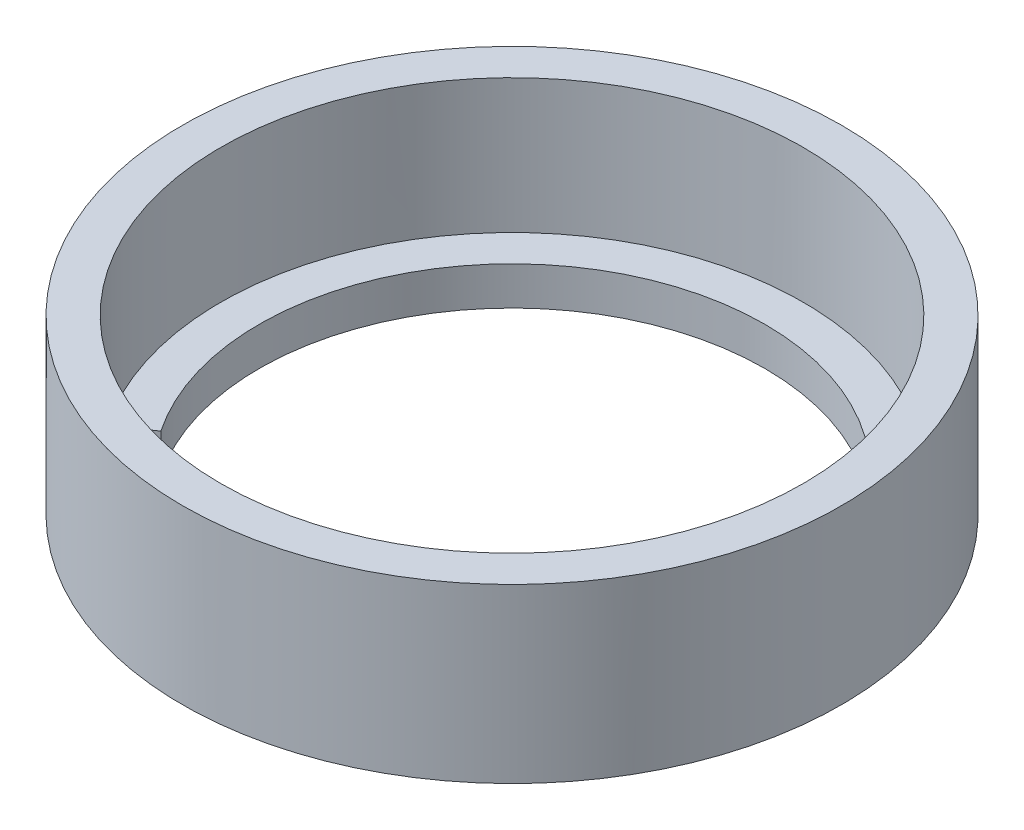
ISO-10303-21;
HEADER;
FILE_DESCRIPTION(('STEP AP214'),'2;1');
FILE_NAME('part.step','',(''),(''),'','','');
FILE_SCHEMA(('AUTOMOTIVE_DESIGN { 1 0 10303 214 1 1 1 1 }'));
ENDSEC;
DATA;
#1=APPLICATION_CONTEXT('core data for automotive mechanical design processes');
#2=APPLICATION_PROTOCOL_DEFINITION('international standard','automotive_design',2000,#1);
#3=PRODUCT_CONTEXT('',#1,'mechanical');
#4=PRODUCT('Part','Part','',(#3));
#5=PRODUCT_RELATED_PRODUCT_CATEGORY('part','',(#4));
#6=PRODUCT_DEFINITION_FORMATION('','',#4);
#7=PRODUCT_DEFINITION_CONTEXT('part definition',#1,'design');
#8=PRODUCT_DEFINITION('design','',#6,#7);
#9=PRODUCT_DEFINITION_SHAPE('','',#8);
#10=(LENGTH_UNIT() NAMED_UNIT(*) SI_UNIT(.MILLI.,.METRE.));
#11=(NAMED_UNIT(*) PLANE_ANGLE_UNIT() SI_UNIT($,.RADIAN.));
#12=(NAMED_UNIT(*) SI_UNIT($,.STERADIAN.) SOLID_ANGLE_UNIT());
#13=UNCERTAINTY_MEASURE_WITH_UNIT(LENGTH_MEASURE(1.E-05),#10,'distance_accuracy_value','');
#14=(GEOMETRIC_REPRESENTATION_CONTEXT(3) GLOBAL_UNCERTAINTY_ASSIGNED_CONTEXT((#13)) GLOBAL_UNIT_ASSIGNED_CONTEXT((#10,
#11,#12)) REPRESENTATION_CONTEXT('',''));
#15=CARTESIAN_POINT('',(0.,0.,0.));
#16=DIRECTION('',(0.,0.,1.));
#17=DIRECTION('',(1.,0.,0.));
#18=AXIS2_PLACEMENT_3D('',#15,#16,#17);
#19=CARTESIAN_POINT('',(0.,7.,0.));
#20=DIRECTION('',(0.,1.,0.));
#21=DIRECTION('',(0.,0.,1.));
#22=AXIS2_PLACEMENT_3D('',#19,#20,#21);
#23=PLANE('',#22);
#24=CARTESIAN_POINT('',(0.,7.,0.));
#25=DIRECTION('',(0.,1.,0.));
#26=DIRECTION('',(0.,0.,1.));
#27=AXIS2_PLACEMENT_3D('',#24,#25,#26);
#28=CIRCLE('',#27,17.2);
#29=CARTESIAN_POINT('',(0.,7.,17.2));
#30=VERTEX_POINT('',#29);
#31=EDGE_CURVE('E11',#30,#30,#28,.T.);
#32=ORIENTED_EDGE('',*,*,#31,.T.);
#33=EDGE_LOOP('',(#32));
#34=FACE_BOUND('',#33,.T.);
#35=CARTESIAN_POINT('',(0.,7.,0.));
#36=DIRECTION('',(0.,1.,0.));
#37=DIRECTION('',(0.,0.,1.));
#38=AXIS2_PLACEMENT_3D('',#35,#36,#37);
#39=CIRCLE('',#38,15.2);
#40=CARTESIAN_POINT('',(0.,7.,15.2));
#41=VERTEX_POINT('',#40);
#42=EDGE_CURVE('E46',#41,#41,#39,.T.);
#43=ORIENTED_EDGE('',*,*,#42,.F.);
#44=EDGE_LOOP('',(#43));
#45=FACE_BOUND('',#44,.T.);
#46=ADVANCED_FACE('F37',(#34,#45),#23,.T.);
#47=CARTESIAN_POINT('',(0.,7.,0.));
#48=DIRECTION('',(0.,-1.,0.));
#49=DIRECTION('',(0.,0.,-1.));
#50=AXIS2_PLACEMENT_3D('',#47,#48,#49);
#51=CYLINDRICAL_SURFACE('',#50,17.2);
#52=ORIENTED_EDGE('',*,*,#31,.F.);
#53=EDGE_LOOP('',(#52));
#54=FACE_BOUND('',#53,.T.);
#55=CARTESIAN_POINT('',(0.,-2.,0.));
#56=DIRECTION('',(0.,-1.,0.));
#57=DIRECTION('',(0.,0.,-1.));
#58=AXIS2_PLACEMENT_3D('',#55,#56,#57);
#59=CIRCLE('',#58,17.2);
#60=CARTESIAN_POINT('',(0.,-2.,-17.2));
#61=VERTEX_POINT('',#60);
#62=EDGE_CURVE('E124',#61,#61,#59,.T.);
#63=ORIENTED_EDGE('',*,*,#62,.F.);
#64=EDGE_LOOP('',(#63));
#65=FACE_BOUND('',#64,.T.);
#66=ADVANCED_FACE('F39',(#54,#65),#51,.T.);
#67=CARTESIAN_POINT('',(0.,7.,0.));
#68=DIRECTION('',(0.,-1.,0.));
#69=DIRECTION('',(0.,0.,-1.));
#70=AXIS2_PLACEMENT_3D('',#67,#68,#69);
#71=CYLINDRICAL_SURFACE('',#70,15.2);
#72=ORIENTED_EDGE('',*,*,#42,.T.);
#73=EDGE_LOOP('',(#72));
#74=FACE_BOUND('',#73,.T.);
#75=CARTESIAN_POINT('',(0.,0.,0.));
#76=DIRECTION('',(0.,1.,0.));
#77=DIRECTION('',(0.,0.,1.));
#78=AXIS2_PLACEMENT_3D('',#75,#76,#77);
#79=CIRCLE('',#78,15.2);
#80=CARTESIAN_POINT('',(12.5913147397296,0.,8.51462231253208));
#81=VERTEX_POINT('',#80);
#82=CARTESIAN_POINT('',(-12.5913147397296,0.,8.51462231253206));
#83=VERTEX_POINT('',#82);
#84=EDGE_CURVE('E61',#81,#83,#79,.T.);
#85=ORIENTED_EDGE('',*,*,#84,.F.);
#86=DIRECTION('',(0.,1.,0.));
#87=VECTOR('',#86,1.);
#88=CARTESIAN_POINT('',(12.5913147397296,-2.,8.51462231253208));
#89=LINE('',#88,#87);
#90=CARTESIAN_POINT('',(12.5913147397296,-2.,8.51462231253208));
#91=VERTEX_POINT('',#90);
#92=EDGE_CURVE('E125',#91,#81,#89,.T.);
#93=ORIENTED_EDGE('',*,*,#92,.F.);
#94=CARTESIAN_POINT('',(0.,-2.,0.));
#95=DIRECTION('',(0.,-1.,0.));
#96=DIRECTION('',(0.,0.,1.));
#97=AXIS2_PLACEMENT_3D('',#94,#95,#96);
#98=CIRCLE('',#97,15.2);
#99=CARTESIAN_POINT('',(4.20695679802556,-2.,14.6062149271995));
#100=VERTEX_POINT('',#99);
#101=EDGE_CURVE('E130',#91,#100,#98,.T.);
#102=ORIENTED_EDGE('',*,*,#101,.T.);
#103=DIRECTION('',(0.,1.,0.));
#104=VECTOR('',#103,1.);
#105=CARTESIAN_POINT('',(4.20695679802556,-2.,14.6062149271995));
#106=LINE('',#105,#104);
#107=CARTESIAN_POINT('',(4.20695679802556,0.,14.6062149271995));
#108=VERTEX_POINT('',#107);
#109=EDGE_CURVE('E167',#100,#108,#106,.T.);
#110=ORIENTED_EDGE('',*,*,#109,.T.);
#111=CARTESIAN_POINT('',(-4.20695679802558,0.,14.6062149271995));
#112=VERTEX_POINT('',#111);
#113=EDGE_CURVE('E53',#112,#108,#79,.T.);
#114=ORIENTED_EDGE('',*,*,#113,.F.);
#115=DIRECTION('',(0.,1.,0.));
#116=VECTOR('',#115,1.);
#117=CARTESIAN_POINT('',(-4.20695679802559,-2.,14.6062149271995));
#118=LINE('',#117,#116);
#119=CARTESIAN_POINT('',(-4.20695679802559,-2.,14.6062149271995));
#120=VERTEX_POINT('',#119);
#121=EDGE_CURVE('E161',#120,#112,#118,.T.);
#122=ORIENTED_EDGE('',*,*,#121,.F.);
#123=CARTESIAN_POINT('',(0.,-2.,0.));
#124=DIRECTION('',(0.,-1.,0.));
#125=DIRECTION('',(0.,0.,1.));
#126=AXIS2_PLACEMENT_3D('',#123,#124,#125);
#127=CIRCLE('',#126,15.2);
#128=CARTESIAN_POINT('',(-12.5913147397296,-2.,8.51462231253206));
#129=VERTEX_POINT('',#128);
#130=EDGE_CURVE('E140',#120,#129,#127,.T.);
#131=ORIENTED_EDGE('',*,*,#130,.T.);
#132=DIRECTION('',(0.,1.,0.));
#133=VECTOR('',#132,1.);
#134=CARTESIAN_POINT('',(-12.5913147397296,-2.,8.51462231253206));
#135=LINE('',#134,#133);
#136=EDGE_CURVE('E159',#129,#83,#135,.T.);
#137=ORIENTED_EDGE('',*,*,#136,.T.);
#138=EDGE_LOOP('',(#85,#93,#102,#110,#114,#122,#131,#137));
#139=FACE_BOUND('',#138,.T.);
#140=ADVANCED_FACE('F179',(#74,#139),#71,.F.);
#141=CARTESIAN_POINT('',(0.,0.,0.));
#142=DIRECTION('',(0.,-1.,0.));
#143=DIRECTION('',(0.,0.,-1.));
#144=AXIS2_PLACEMENT_3D('',#141,#142,#143);
#145=PLANE('',#144);
#146=DIRECTION('',(0.82837596971905,0.,0.560172520561321));
#147=VECTOR('',#146,1.);
#148=CARTESIAN_POINT('',(10.9345628002915,0.,7.39427727140944));
#149=LINE('',#148,#147);
#150=CARTESIAN_POINT('',(10.9345628002915,0.,7.39427727140944));
#151=VERTEX_POINT('',#150);
#152=EDGE_CURVE('E123',#151,#81,#149,.T.);
#153=ORIENTED_EDGE('',*,*,#152,.T.);
#154=ORIENTED_EDGE('',*,*,#84,.T.);
#155=DIRECTION('',(0.828375969719051,0.,-0.56017252056132));
#156=VECTOR('',#155,1.);
#157=CARTESIAN_POINT('',(-10.9345628002915,0.,7.39427727140942));
#158=LINE('',#157,#156);
#159=CARTESIAN_POINT('',(-10.9345628002915,0.,7.39427727140942));
#160=VERTEX_POINT('',#159);
#161=EDGE_CURVE('E117',#83,#160,#158,.T.);
#162=ORIENTED_EDGE('',*,*,#161,.T.);
#163=CARTESIAN_POINT('',(0.,0.,0.));
#164=DIRECTION('',(0.,-1.,0.));
#165=DIRECTION('',(0.,0.,-1.));
#166=AXIS2_PLACEMENT_3D('',#163,#164,#165);
#167=CIRCLE('',#166,13.2);
#168=EDGE_CURVE('E145',#160,#151,#167,.T.);
#169=ORIENTED_EDGE('',*,*,#168,.T.);
#170=EDGE_LOOP('',(#153,#154,#162,#169));
#171=FACE_BOUND('',#170,.T.);
#172=ADVANCED_FACE('F195',(#171),#145,.F.);
#173=DIRECTION('',(-0.276773473554315,0.,0.960935192578916));
#174=VECTOR('',#173,1.);
#175=CARTESIAN_POINT('',(-3.65340985091695,0.,12.6843445420417));
#176=LINE('',#175,#174);
#177=CARTESIAN_POINT('',(-3.65340985091695,0.,12.6843445420417));
#178=VERTEX_POINT('',#177);
#179=EDGE_CURVE('E154',#178,#112,#176,.T.);
#180=ORIENTED_EDGE('',*,*,#179,.T.);
#181=ORIENTED_EDGE('',*,*,#113,.T.);
#182=DIRECTION('',(-0.276773473554313,0.,-0.960935192578917));
#183=VECTOR('',#182,1.);
#184=CARTESIAN_POINT('',(3.65340985091694,0.,12.6843445420417));
#185=LINE('',#184,#183);
#186=CARTESIAN_POINT('',(3.65340985091694,0.,12.6843445420417));
#187=VERTEX_POINT('',#186);
#188=EDGE_CURVE('E148',#108,#187,#185,.T.);
#189=ORIENTED_EDGE('',*,*,#188,.T.);
#190=CARTESIAN_POINT('',(0.,0.,0.));
#191=DIRECTION('',(0.,-1.,0.));
#192=DIRECTION('',(0.,0.,-1.));
#193=AXIS2_PLACEMENT_3D('',#190,#191,#192);
#194=CIRCLE('',#193,13.2);
#195=EDGE_CURVE('E151',#187,#178,#194,.T.);
#196=ORIENTED_EDGE('',*,*,#195,.T.);
#197=EDGE_LOOP('',(#180,#181,#189,#196));
#198=FACE_BOUND('',#197,.T.);
#199=ADVANCED_FACE('F175',(#198),#145,.F.);
#200=CARTESIAN_POINT('',(0.,-2.,0.));
#201=DIRECTION('',(0.,-1.,0.));
#202=DIRECTION('',(0.,0.,-1.));
#203=AXIS2_PLACEMENT_3D('',#200,#201,#202);
#204=PLANE('',#203);
#205=ORIENTED_EDGE('',*,*,#62,.T.);
#206=EDGE_LOOP('',(#205));
#207=FACE_BOUND('',#206,.T.);
#208=DIRECTION('',(0.82837596971905,0.,0.560172520561321));
#209=VECTOR('',#208,1.);
#210=CARTESIAN_POINT('',(10.9345628002915,-2.,7.39427727140944));
#211=LINE('',#210,#209);
#212=CARTESIAN_POINT('',(10.9345628002915,-2.,7.39427727140944));
#213=VERTEX_POINT('',#212);
#214=EDGE_CURVE('E116',#213,#91,#211,.T.);
#215=ORIENTED_EDGE('',*,*,#214,.F.);
#216=CARTESIAN_POINT('',(0.,-2.,0.));
#217=DIRECTION('',(0.,-1.,0.));
#218=DIRECTION('',(0.,0.,-1.));
#219=AXIS2_PLACEMENT_3D('',#216,#217,#218);
#220=CIRCLE('',#219,13.2);
#221=CARTESIAN_POINT('',(-10.9345628002915,-2.,7.39427727140942));
#222=VERTEX_POINT('',#221);
#223=EDGE_CURVE('E106',#222,#213,#220,.T.);
#224=ORIENTED_EDGE('',*,*,#223,.F.);
#225=DIRECTION('',(0.828375969719051,0.,-0.56017252056132));
#226=VECTOR('',#225,1.);
#227=CARTESIAN_POINT('',(-10.9345628002915,-2.,7.39427727140942));
#228=LINE('',#227,#226);
#229=EDGE_CURVE('E143',#129,#222,#228,.T.);
#230=ORIENTED_EDGE('',*,*,#229,.F.);
#231=ORIENTED_EDGE('',*,*,#130,.F.);
#232=DIRECTION('',(-0.276773473554315,0.,0.960935192578916));
#233=VECTOR('',#232,1.);
#234=CARTESIAN_POINT('',(-3.65340985091695,-2.,12.6843445420417));
#235=LINE('',#234,#233);
#236=CARTESIAN_POINT('',(-3.65340985091695,-2.,12.6843445420417));
#237=VERTEX_POINT('',#236);
#238=EDGE_CURVE('E138',#237,#120,#235,.T.);
#239=ORIENTED_EDGE('',*,*,#238,.F.);
#240=CARTESIAN_POINT('',(0.,-2.,0.));
#241=DIRECTION('',(0.,-1.,0.));
#242=DIRECTION('',(0.,0.,-1.));
#243=AXIS2_PLACEMENT_3D('',#240,#241,#242);
#244=CIRCLE('',#243,13.2);
#245=CARTESIAN_POINT('',(3.65340985091694,-2.,12.6843445420417));
#246=VERTEX_POINT('',#245);
#247=EDGE_CURVE('E136',#246,#237,#244,.T.);
#248=ORIENTED_EDGE('',*,*,#247,.F.);
#249=DIRECTION('',(-0.276773473554313,0.,-0.960935192578917));
#250=VECTOR('',#249,1.);
#251=CARTESIAN_POINT('',(3.65340985091694,-2.,12.6843445420417));
#252=LINE('',#251,#250);
#253=EDGE_CURVE('E132',#100,#246,#252,.T.);
#254=ORIENTED_EDGE('',*,*,#253,.F.);
#255=ORIENTED_EDGE('',*,*,#101,.F.);
#256=EDGE_LOOP('',(#215,#224,#230,#231,#239,#248,#254,#255));
#257=FACE_BOUND('',#256,.T.);
#258=ADVANCED_FACE('F128',(#207,#257),#204,.T.);
#259=CARTESIAN_POINT('',(0.,-2.,0.));
#260=DIRECTION('',(0.,1.,0.));
#261=DIRECTION('',(0.,0.,1.));
#262=AXIS2_PLACEMENT_3D('',#259,#260,#261);
#263=CYLINDRICAL_SURFACE('',#262,13.2);
#264=ORIENTED_EDGE('',*,*,#168,.F.);
#265=DIRECTION('',(0.,1.,0.));
#266=VECTOR('',#265,1.);
#267=CARTESIAN_POINT('',(-10.9345628002915,-2.,7.39427727140942));
#268=LINE('',#267,#266);
#269=EDGE_CURVE('E112',#222,#160,#268,.T.);
#270=ORIENTED_EDGE('',*,*,#269,.F.);
#271=ORIENTED_EDGE('',*,*,#223,.T.);
#272=DIRECTION('',(0.,1.,0.));
#273=VECTOR('',#272,1.);
#274=CARTESIAN_POINT('',(10.9345628002915,-2.,7.39427727140944));
#275=LINE('',#274,#273);
#276=EDGE_CURVE('E109',#213,#151,#275,.T.);
#277=ORIENTED_EDGE('',*,*,#276,.T.);
#278=EDGE_LOOP('',(#264,#270,#271,#277));
#279=FACE_BOUND('',#278,.T.);
#280=ADVANCED_FACE('F108',(#279),#263,.F.);
#281=CARTESIAN_POINT('',(10.9345628002915,-2.,7.39427727140944));
#282=DIRECTION('',(-0.560172520561321,0.,0.82837596971905));
#283=DIRECTION('',(0.82837596971905,0.,0.560172520561321));
#284=AXIS2_PLACEMENT_3D('',#281,#282,#283);
#285=PLANE('',#284);
#286=ORIENTED_EDGE('',*,*,#152,.F.);
#287=ORIENTED_EDGE('',*,*,#276,.F.);
#288=ORIENTED_EDGE('',*,*,#214,.T.);
#289=ORIENTED_EDGE('',*,*,#92,.T.);
#290=EDGE_LOOP('',(#286,#287,#288,#289));
#291=FACE_BOUND('',#290,.T.);
#292=ADVANCED_FACE('F120',(#291),#285,.T.);
#293=CARTESIAN_POINT('',(3.65340985091694,-2.,12.6843445420417));
#294=DIRECTION('',(0.960935192578917,0.,-0.276773473554313));
#295=DIRECTION('',(-0.276773473554314,0.,-0.960935192578917));
#296=AXIS2_PLACEMENT_3D('',#293,#294,#295);
#297=PLANE('',#296);
#298=ORIENTED_EDGE('',*,*,#188,.F.);
#299=ORIENTED_EDGE('',*,*,#109,.F.);
#300=ORIENTED_EDGE('',*,*,#253,.T.);
#301=DIRECTION('',(0.,1.,0.));
#302=VECTOR('',#301,1.);
#303=CARTESIAN_POINT('',(3.65340985091694,-2.,12.6843445420417));
#304=LINE('',#303,#302);
#305=EDGE_CURVE('E165',#246,#187,#304,.T.);
#306=ORIENTED_EDGE('',*,*,#305,.T.);
#307=EDGE_LOOP('',(#298,#299,#300,#306));
#308=FACE_BOUND('',#307,.T.);
#309=ADVANCED_FACE('F181',(#308),#297,.T.);
#310=CARTESIAN_POINT('',(0.,-2.,0.));
#311=DIRECTION('',(0.,1.,0.));
#312=DIRECTION('',(0.,0.,1.));
#313=AXIS2_PLACEMENT_3D('',#310,#311,#312);
#314=CYLINDRICAL_SURFACE('',#313,13.2);
#315=ORIENTED_EDGE('',*,*,#195,.F.);
#316=ORIENTED_EDGE('',*,*,#305,.F.);
#317=ORIENTED_EDGE('',*,*,#247,.T.);
#318=DIRECTION('',(0.,1.,0.));
#319=VECTOR('',#318,1.);
#320=CARTESIAN_POINT('',(-3.65340985091695,-2.,12.6843445420417));
#321=LINE('',#320,#319);
#322=EDGE_CURVE('E163',#237,#178,#321,.T.);
#323=ORIENTED_EDGE('',*,*,#322,.T.);
#324=EDGE_LOOP('',(#315,#316,#317,#323));
#325=FACE_BOUND('',#324,.T.);
#326=ADVANCED_FACE('F186',(#325),#314,.F.);
#327=CARTESIAN_POINT('',(-3.65340985091695,-2.,12.6843445420417));
#328=DIRECTION('',(-0.960935192578916,0.,-0.276773473554315));
#329=DIRECTION('',(-0.276773473554315,0.,0.960935192578916));
#330=AXIS2_PLACEMENT_3D('',#327,#328,#329);
#331=PLANE('',#330);
#332=ORIENTED_EDGE('',*,*,#179,.F.);
#333=ORIENTED_EDGE('',*,*,#322,.F.);
#334=ORIENTED_EDGE('',*,*,#238,.T.);
#335=ORIENTED_EDGE('',*,*,#121,.T.);
#336=EDGE_LOOP('',(#332,#333,#334,#335));
#337=FACE_BOUND('',#336,.T.);
#338=ADVANCED_FACE('F190',(#337),#331,.T.);
#339=CARTESIAN_POINT('',(-10.9345628002915,-2.,7.39427727140942));
#340=DIRECTION('',(0.56017252056132,0.,0.828375969719051));
#341=DIRECTION('',(0.828375969719051,0.,-0.56017252056132));
#342=AXIS2_PLACEMENT_3D('',#339,#340,#341);
#343=PLANE('',#342);
#344=ORIENTED_EDGE('',*,*,#161,.F.);
#345=ORIENTED_EDGE('',*,*,#136,.F.);
#346=ORIENTED_EDGE('',*,*,#229,.T.);
#347=ORIENTED_EDGE('',*,*,#269,.T.);
#348=EDGE_LOOP('',(#344,#345,#346,#347));
#349=FACE_BOUND('',#348,.T.);
#350=ADVANCED_FACE('F194',(#349),#343,.T.);
#351=CLOSED_SHELL('',(#46,#66,#140,#172,#199,#258,#280,#292,#309,#326,#338,#350));
#352=MANIFOLD_SOLID_BREP('B2',#351);
#353=ADVANCED_BREP_SHAPE_REPRESENTATION('',(#18,#352),#14);
#354=SHAPE_DEFINITION_REPRESENTATION(#9,#353);
ENDSEC;
END-ISO-10303-21;
